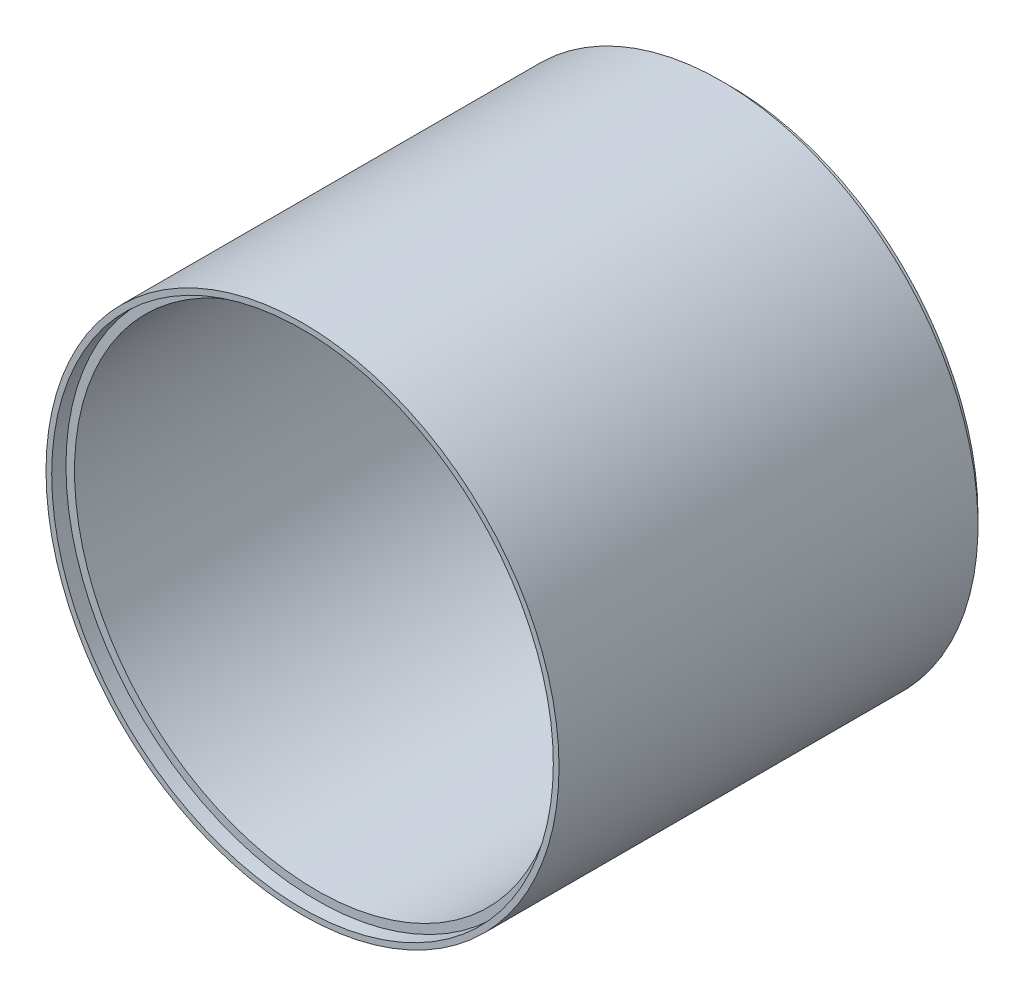
ISO-10303-21;
HEADER;
FILE_DESCRIPTION(('STEP AP214'),'2;1');
FILE_NAME('part.step','',(''),(''),'','','');
FILE_SCHEMA(('AUTOMOTIVE_DESIGN { 1 0 10303 214 1 1 1 1 }'));
ENDSEC;
DATA;
#1=APPLICATION_CONTEXT('core data for automotive mechanical design processes');
#2=APPLICATION_PROTOCOL_DEFINITION('international standard','automotive_design',2000,#1);
#3=PRODUCT_CONTEXT('',#1,'mechanical');
#4=PRODUCT('Part','Part','',(#3));
#5=PRODUCT_RELATED_PRODUCT_CATEGORY('part','',(#4));
#6=PRODUCT_DEFINITION_FORMATION('','',#4);
#7=PRODUCT_DEFINITION_CONTEXT('part definition',#1,'design');
#8=PRODUCT_DEFINITION('design','',#6,#7);
#9=PRODUCT_DEFINITION_SHAPE('','',#8);
#10=(LENGTH_UNIT() NAMED_UNIT(*) SI_UNIT(.MILLI.,.METRE.));
#11=(NAMED_UNIT(*) PLANE_ANGLE_UNIT() SI_UNIT($,.RADIAN.));
#12=(NAMED_UNIT(*) SI_UNIT($,.STERADIAN.) SOLID_ANGLE_UNIT());
#13=UNCERTAINTY_MEASURE_WITH_UNIT(LENGTH_MEASURE(1.E-05),#10,'distance_accuracy_value','');
#14=(GEOMETRIC_REPRESENTATION_CONTEXT(3) GLOBAL_UNCERTAINTY_ASSIGNED_CONTEXT((#13)) GLOBAL_UNIT_ASSIGNED_CONTEXT((#10,
#11,#12)) REPRESENTATION_CONTEXT('',''));
#15=CARTESIAN_POINT('',(0.,0.,0.));
#16=DIRECTION('',(0.,0.,1.));
#17=DIRECTION('',(1.,0.,0.));
#18=AXIS2_PLACEMENT_3D('',#15,#16,#17);
#19=CARTESIAN_POINT('',(0.,0.,20.));
#20=DIRECTION('',(0.,0.,1.));
#21=DIRECTION('',(1.,0.,0.));
#22=AXIS2_PLACEMENT_3D('',#19,#20,#21);
#23=CYLINDRICAL_SURFACE('',#22,85.);
#24=CARTESIAN_POINT('',(0.,0.,20.));
#25=DIRECTION('',(0.,0.,1.));
#26=DIRECTION('',(1.,0.,0.));
#27=AXIS2_PLACEMENT_3D('',#24,#25,#26);
#28=CIRCLE('',#27,85.);
#29=CARTESIAN_POINT('',(54.1481481481481,65.5208215159594,20.));
#30=VERTEX_POINT('',#29);
#31=CARTESIAN_POINT('',(54.1481481481481,-65.5208215159594,20.));
#32=VERTEX_POINT('',#31);
#33=EDGE_CURVE('E198',#30,#32,#28,.T.);
#34=ORIENTED_EDGE('',*,*,#33,.F.);
#35=CARTESIAN_POINT('',(0.,0.,3.));
#36=DIRECTION('',(-0.299538105961624,0.,0.954084337507394));
#37=DIRECTION('',(0.954084337507394,0.,0.299538105961624));
#38=AXIS2_PLACEMENT_3D('',#35,#36,#37);
#39=ELLIPSE('',#38,89.0906565158253,85.);
#40=EDGE_CURVE('E178',#32,#30,#39,.T.);
#41=ORIENTED_EDGE('',*,*,#40,.F.);
#42=EDGE_LOOP('',(#34,#41));
#43=FACE_BOUND('',#42,.T.);
#44=CARTESIAN_POINT('',(0.,0.,145.));
#45=DIRECTION('',(0.,0.,1.));
#46=DIRECTION('',(1.,0.,0.));
#47=AXIS2_PLACEMENT_3D('',#44,#45,#46);
#48=CIRCLE('',#47,85.);
#49=CARTESIAN_POINT('',(85.,0.,145.));
#50=VERTEX_POINT('',#49);
#51=EDGE_CURVE('E45',#50,#50,#48,.F.);
#52=ORIENTED_EDGE('',*,*,#51,.F.);
#53=EDGE_LOOP('',(#52));
#54=FACE_BOUND('',#53,.T.);
#55=ADVANCED_FACE('F39',(#43,#54),#23,.F.);
#56=CARTESIAN_POINT('',(0.,0.,150.));
#57=DIRECTION('',(0.,0.,-1.));
#58=DIRECTION('',(-1.,0.,0.));
#59=AXIS2_PLACEMENT_3D('',#56,#57,#58);
#60=CYLINDRICAL_SURFACE('',#59,67.);
#61=CARTESIAN_POINT('',(0.,0.,0.));
#62=DIRECTION('',(0.,0.,-1.));
#63=DIRECTION('',(-1.,0.,0.));
#64=AXIS2_PLACEMENT_3D('',#61,#62,#63);
#65=CIRCLE('',#64,67.);
#66=CARTESIAN_POINT('',(0.,-67.,0.));
#67=VERTEX_POINT('',#66);
#68=CARTESIAN_POINT('',(0.,67.,0.));
#69=VERTEX_POINT('',#68);
#70=EDGE_CURVE('E202',#67,#69,#65,.T.);
#71=ORIENTED_EDGE('',*,*,#70,.T.);
#72=DIRECTION('',(0.,0.,-1.));
#73=VECTOR('',#72,1.);
#74=CARTESIAN_POINT('',(0.,67.,150.));
#75=LINE('',#74,#73);
#76=CARTESIAN_POINT('',(0.,67.,1.99999999999986));
#77=VERTEX_POINT('',#76);
#78=EDGE_CURVE('E182',#69,#77,#75,.F.);
#79=ORIENTED_EDGE('',*,*,#78,.T.);
#80=CARTESIAN_POINT('',(0.,0.,1.99999999999986));
#81=DIRECTION('',(0.,0.,1.));
#82=DIRECTION('',(1.,0.,0.));
#83=AXIS2_PLACEMENT_3D('',#80,#81,#82);
#84=CIRCLE('',#83,67.);
#85=CARTESIAN_POINT('',(0.,-67.,1.99999999999986));
#86=VERTEX_POINT('',#85);
#87=EDGE_CURVE('E216',#77,#86,#84,.T.);
#88=ORIENTED_EDGE('',*,*,#87,.T.);
#89=DIRECTION('',(0.,0.,-1.));
#90=VECTOR('',#89,1.);
#91=CARTESIAN_POINT('',(0.,-67.,150.));
#92=LINE('',#91,#90);
#93=EDGE_CURVE('E192',#67,#86,#92,.F.);
#94=ORIENTED_EDGE('',*,*,#93,.F.);
#95=EDGE_LOOP('',(#71,#79,#88,#94));
#96=FACE_BOUND('',#95,.T.);
#97=ADVANCED_FACE('F265',(#96),#60,.F.);
#98=CARTESIAN_POINT('',(0.,0.,150.));
#99=DIRECTION('',(0.,0.,-1.));
#100=DIRECTION('',(-1.,0.,0.));
#101=AXIS2_PLACEMENT_3D('',#98,#99,#100);
#102=CYLINDRICAL_SURFACE('',#101,90.);
#103=CARTESIAN_POINT('',(0.,0.,150.));
#104=DIRECTION('',(0.,0.,1.));
#105=DIRECTION('',(1.,0.,0.));
#106=AXIS2_PLACEMENT_3D('',#103,#104,#105);
#107=CIRCLE('',#106,90.);
#108=CARTESIAN_POINT('',(90.,0.,150.));
#109=VERTEX_POINT('',#108);
#110=EDGE_CURVE('E213',#109,#109,#107,.T.);
#111=ORIENTED_EDGE('',*,*,#110,.F.);
#112=EDGE_LOOP('',(#111));
#113=FACE_BOUND('',#112,.T.);
#114=CARTESIAN_POINT('',(0.,0.,3.));
#115=DIRECTION('',(0.,0.,-1.));
#116=DIRECTION('',(-1.,0.,0.));
#117=AXIS2_PLACEMENT_3D('',#114,#115,#116);
#118=CIRCLE('',#117,90.);
#119=CARTESIAN_POINT('',(-90.,0.,3.));
#120=VERTEX_POINT('',#119);
#121=EDGE_CURVE('E208',#120,#120,#118,.T.);
#122=ORIENTED_EDGE('',*,*,#121,.F.);
#123=EDGE_LOOP('',(#122));
#124=FACE_BOUND('',#123,.T.);
#125=ADVANCED_FACE('F271',(#113,#124),#102,.T.);
#126=CARTESIAN_POINT('',(0.,0.,150.));
#127=DIRECTION('',(0.,0.,1.));
#128=DIRECTION('',(1.,0.,0.));
#129=AXIS2_PLACEMENT_3D('',#126,#127,#128);
#130=PLANE('',#129);
#131=CARTESIAN_POINT('',(0.,0.,150.));
#132=DIRECTION('',(0.,0.,1.));
#133=DIRECTION('',(1.,0.,0.));
#134=AXIS2_PLACEMENT_3D('',#131,#132,#133);
#135=CIRCLE('',#134,88.);
#136=CARTESIAN_POINT('',(88.,0.,150.));
#137=VERTEX_POINT('',#136);
#138=EDGE_CURVE('E454',#137,#137,#135,.T.);
#139=ORIENTED_EDGE('',*,*,#138,.F.);
#140=EDGE_LOOP('',(#139));
#141=FACE_BOUND('',#140,.T.);
#142=ORIENTED_EDGE('',*,*,#110,.T.);
#143=EDGE_LOOP('',(#142));
#144=FACE_BOUND('',#143,.T.);
#145=ADVANCED_FACE('F260',(#141,#144),#130,.T.);
#146=CARTESIAN_POINT('',(0.,0.,3.));
#147=DIRECTION('',(0.,0.,-1.));
#148=DIRECTION('',(-1.,0.,0.));
#149=AXIS2_PLACEMENT_3D('',#146,#147,#148);
#150=PLANE('',#149);
#151=CARTESIAN_POINT('',(0.,0.,3.));
#152=DIRECTION('',(0.,0.,-1.));
#153=DIRECTION('',(-1.,0.,0.));
#154=AXIS2_PLACEMENT_3D('',#151,#152,#153);
#155=CIRCLE('',#154,87.);
#156=CARTESIAN_POINT('',(-87.,0.,3.));
#157=VERTEX_POINT('',#156);
#158=EDGE_CURVE('E205',#157,#157,#155,.T.);
#159=ORIENTED_EDGE('',*,*,#158,.F.);
#160=EDGE_LOOP('',(#159));
#161=FACE_BOUND('',#160,.T.);
#162=ORIENTED_EDGE('',*,*,#121,.T.);
#163=EDGE_LOOP('',(#162));
#164=FACE_BOUND('',#163,.T.);
#165=ADVANCED_FACE('F254',(#161,#164),#150,.T.);
#166=CARTESIAN_POINT('',(0.,0.,3.));
#167=DIRECTION('',(0.,0.,-1.));
#168=DIRECTION('',(-1.,0.,0.));
#169=AXIS2_PLACEMENT_3D('',#166,#167,#168);
#170=CYLINDRICAL_SURFACE('',#169,87.);
#171=ORIENTED_EDGE('',*,*,#158,.T.);
#172=EDGE_LOOP('',(#171));
#173=FACE_BOUND('',#172,.T.);
#174=CARTESIAN_POINT('',(0.,0.,0.));
#175=DIRECTION('',(0.,0.,-1.));
#176=DIRECTION('',(-1.,0.,0.));
#177=AXIS2_PLACEMENT_3D('',#174,#175,#176);
#178=CIRCLE('',#177,87.);
#179=CARTESIAN_POINT('',(-87.,0.,0.));
#180=VERTEX_POINT('',#179);
#181=EDGE_CURVE('E204',#180,#180,#178,.T.);
#182=ORIENTED_EDGE('',*,*,#181,.F.);
#183=EDGE_LOOP('',(#182));
#184=FACE_BOUND('',#183,.T.);
#185=ADVANCED_FACE('F245',(#173,#184),#170,.T.);
#186=CARTESIAN_POINT('',(0.,0.,0.));
#187=DIRECTION('',(0.,0.,1.));
#188=DIRECTION('',(1.,0.,0.));
#189=AXIS2_PLACEMENT_3D('',#186,#187,#188);
#190=PLANE('',#189);
#191=CARTESIAN_POINT('',(14.1198656578644,72.6404115751271,0.));
#192=DIRECTION('',(0.,0.,-1.));
#193=DIRECTION('',(1.,0.,0.));
#194=AXIS2_PLACEMENT_3D('',#191,#192,#193);
#195=CIRCLE('',#194,2.);
#196=CARTESIAN_POINT('',(16.1198656578644,72.6404115751271,0.));
#197=VERTEX_POINT('',#196);
#198=EDGE_CURVE('E114',#197,#197,#195,.T.);
#199=ORIENTED_EDGE('',*,*,#198,.F.);
#200=EDGE_LOOP('',(#199));
#201=FACE_BOUND('',#200,.T.);
#202=CARTESIAN_POINT('',(38.1128175433437,63.4303802519565,0.));
#203=DIRECTION('',(0.,0.,-1.));
#204=DIRECTION('',(1.,0.,0.));
#205=AXIS2_PLACEMENT_3D('',#202,#203,#204);
#206=CIRCLE('',#205,2.);
#207=CARTESIAN_POINT('',(40.1128175433437,63.4303802519565,0.));
#208=VERTEX_POINT('',#207);
#209=EDGE_CURVE('E131',#208,#208,#206,.T.);
#210=ORIENTED_EDGE('',*,*,#209,.F.);
#211=EDGE_LOOP('',(#210));
#212=FACE_BOUND('',#211,.T.);
#213=CARTESIAN_POINT('',(-14.1198656578644,-72.6404115751271,0.));
#214=DIRECTION('',(0.,0.,-1.));
#215=DIRECTION('',(-1.,0.,0.));
#216=AXIS2_PLACEMENT_3D('',#213,#214,#215);
#217=CIRCLE('',#216,2.);
#218=CARTESIAN_POINT('',(-16.1198656578644,-72.6404115751271,0.));
#219=VERTEX_POINT('',#218);
#220=EDGE_CURVE('E234',#219,#219,#217,.T.);
#221=ORIENTED_EDGE('',*,*,#220,.F.);
#222=EDGE_LOOP('',(#221));
#223=FACE_BOUND('',#222,.T.);
#224=CARTESIAN_POINT('',(-38.1128175433437,-63.4303802519565,0.));
#225=DIRECTION('',(0.,0.,-1.));
#226=DIRECTION('',(-1.,0.,0.));
#227=AXIS2_PLACEMENT_3D('',#224,#225,#226);
#228=CIRCLE('',#227,2.);
#229=CARTESIAN_POINT('',(-40.1128175433437,-63.4303802519565,0.));
#230=VERTEX_POINT('',#229);
#231=EDGE_CURVE('E122',#230,#230,#228,.T.);
#232=ORIENTED_EDGE('',*,*,#231,.F.);
#233=EDGE_LOOP('',(#232));
#234=FACE_BOUND('',#233,.T.);
#235=ORIENTED_EDGE('',*,*,#70,.F.);
#236=DIRECTION('',(0.,1.,0.));
#237=VECTOR('',#236,1.);
#238=CARTESIAN_POINT('',(0.,-90.002,0.));
#239=LINE('',#238,#237);
#240=EDGE_CURVE('E189',#67,#69,#239,.T.);
#241=ORIENTED_EDGE('',*,*,#240,.T.);
#242=EDGE_LOOP('',(#235,#241));
#243=FACE_BOUND('',#242,.T.);
#244=ORIENTED_EDGE('',*,*,#181,.T.);
#245=EDGE_LOOP('',(#244));
#246=FACE_BOUND('',#245,.T.);
#247=ADVANCED_FACE('F242',(#201,#212,#223,#234,#243,#246),#190,.F.);
#248=CARTESIAN_POINT('',(0.,0.,20.));
#249=DIRECTION('',(0.,0.,1.));
#250=DIRECTION('',(1.,0.,0.));
#251=AXIS2_PLACEMENT_3D('',#248,#249,#250);
#252=CONICAL_SURFACE('',#251,85.,0.785398163397446);
#253=CARTESIAN_POINT('',(12.5953954273361,73.9350120989309,10.0002));
#254=CARTESIAN_POINT('',(12.5539055005675,73.8861364375923,9.94505159731924));
#255=CARTESIAN_POINT('',(12.51525466569,73.8358798346999,9.88903835120423));
#256=CARTESIAN_POINT('',(12.4435283525215,73.7330382120116,9.77567500251342));
#257=CARTESIAN_POINT('',(12.410449146893,73.6804547788053,9.7183258231274));
#258=CARTESIAN_POINT('',(12.3497280666459,73.5733618473177,9.60264687192459));
#259=CARTESIAN_POINT('',(12.3220825914501,73.5188536528942,9.54431777744164));
#260=CARTESIAN_POINT('',(12.2721138597675,73.40820020775,9.42693332575546));
#261=CARTESIAN_POINT('',(12.2497920449682,73.3520545181925,9.36787777636552));
#262=CARTESIAN_POINT('',(12.1828659801985,73.1589250799477,9.1663661310484));
#263=CARTESIAN_POINT('',(12.1507301376982,73.0186485763768,9.02272104894406));
#264=CARTESIAN_POINT('',(12.1168805112725,72.7336164860032,8.73600017400353));
#265=CARTESIAN_POINT('',(12.1152066735711,72.5888552671845,8.5929253746293));
#266=CARTESIAN_POINT('',(12.1424142823986,72.3137625295421,8.32610265776778));
#267=CARTESIAN_POINT('',(12.1680567533169,72.1835382446108,8.20192063106123));
#268=CARTESIAN_POINT('',(12.2472458416642,71.9252161966644,7.96045519633825));
#269=CARTESIAN_POINT('',(12.3007397589525,71.7971148873043,7.84315922344215));
#270=CARTESIAN_POINT('',(12.4179244213894,71.5852966783308,7.6543580051057));
#271=CARTESIAN_POINT('',(12.4735976685165,71.4999051473287,7.57975688145264));
#272=CARTESIAN_POINT('',(12.6014294700777,71.3345640739618,7.43900943421858));
#273=CARTESIAN_POINT('',(12.673565645132,71.2546073334115,7.3728518213311));
#274=CARTESIAN_POINT('',(12.8166733602652,71.1208868586155,7.26646913045777));
#275=CARTESIAN_POINT('',(12.8841131136935,71.0653230525396,7.22377702376488));
#276=CARTESIAN_POINT('',(13.0292335082082,70.9615894768474,7.14777632280236));
#277=CARTESIAN_POINT('',(13.1069009407067,70.9134103410325,7.11445579670481));
#278=CARTESIAN_POINT('',(13.2587052985167,70.8335962344724,7.06376335182821));
#279=CARTESIAN_POINT('',(13.3315410127002,70.8005558333034,7.04472475612776));
#280=CARTESIAN_POINT('',(13.48231131403,70.7430398519899,7.01627675398742));
#281=CARTESIAN_POINT('',(13.5602429130233,70.7185593049931,7.00686175733707));
#282=CARTESIAN_POINT('',(13.7192655201312,70.6792273982101,6.99836615087587));
#283=CARTESIAN_POINT('',(13.8003638875597,70.6644000809427,6.99931124056763));
#284=CARTESIAN_POINT('',(13.9629964644908,70.6448905304554,7.01152096010202));
#285=CARTESIAN_POINT('',(14.0445307600421,70.6402103803585,7.02278770821388));
#286=CARTESIAN_POINT('',(14.2029275775018,70.6406193885319,7.05424639748392));
#287=CARTESIAN_POINT('',(14.2798550336461,70.6453857177894,7.0741258717643));
#288=CARTESIAN_POINT('',(14.4302831330955,70.663194060856,7.12152854473348));
#289=CARTESIAN_POINT('',(14.5037823286416,70.6762395375944,7.14905493919899));
#290=CARTESIAN_POINT('',(14.6771240636099,70.7167584950549,7.22374153313179));
#291=CARTESIAN_POINT('',(14.7746410139593,70.7480293553429,7.27424765475845));
#292=CARTESIAN_POINT('',(14.9591897560634,70.8223130974047,7.3848777204776));
#293=CARTESIAN_POINT('',(15.0461979463577,70.8653517263288,7.44502263281008));
#294=CARTESIAN_POINT('',(15.241374855715,70.9792360962718,7.59712083305573));
#295=CARTESIAN_POINT('',(15.3445036058881,71.0543731506283,7.69231233536669));
#296=CARTESIAN_POINT('',(15.5305904666462,71.2173200221315,7.89101814018825));
#297=CARTESIAN_POINT('',(15.6135188625684,71.305148209149,7.99454440903497));
#298=CARTESIAN_POINT('',(15.7841878980739,71.520337403049,8.24134380580242));
#299=CARTESIAN_POINT('',(15.8646536113914,71.6512411085774,8.38655489155565));
#300=CARTESIAN_POINT('',(15.9933465454604,71.924257836033,8.68096725643191));
#301=CARTESIAN_POINT('',(16.0415199503408,72.0663891306414,8.83017476757548));
#302=CARTESIAN_POINT('',(16.0896303057926,72.2858368914104,9.05483419981417));
#303=CARTESIAN_POINT('',(16.1016392658093,72.3605687635505,9.13038928379813));
#304=CARTESIAN_POINT('',(16.1171426025168,72.5114063656978,9.280995329814));
#305=CARTESIAN_POINT('',(16.1206348301819,72.5875124375772,9.35604615984445));
#306=CARTESIAN_POINT('',(16.1179132686188,72.8167004914031,9.57920375714411));
#307=CARTESIAN_POINT('',(16.0986572456622,72.971350272232,9.72603063192244));
#308=CARTESIAN_POINT('',(16.0542068250919,73.1492746745956,9.89027864367059));
#309=CARTESIAN_POINT('',(16.0477028936675,73.1733963619733,9.91244600628079));
#310=CARTESIAN_POINT('',(16.0337295489383,73.2215777886917,9.95651930724711));
#311=CARTESIAN_POINT('',(16.0262605728602,73.2456375510842,9.97842535911391));
#312=CARTESIAN_POINT('',(16.0182957344345,73.2696676790895,10.0002));
#313=B_SPLINE_CURVE_WITH_KNOTS('',3,(#253,#254,#255,#256,#257,#258,#259,#260,#261,#262,#263,
#264,#265,#266,#267,#268,#269,#270,#271,#272,#273,#274,#275,#276,#277,#278,#279,#280,#281,#282,
#283,#284,#285,#286,#287,#288,#289,#290,#291,#292,#293,#294,#295,#296,#297,#298,#299,#300,#301,
#302,#303,#304,#305,#306,#307,#308,#309,#310,#311,#312),.UNSPECIFIED.,.F.,.F.,(4,2,2,2,2,2,2,2,
2,2,2,2,2,2,2,2,2,2,2,2,2,2,2,2,2,2,2,2,2,4),(0.,0.25359201170643,0.507013694425312,
0.760266880829124,1.0135885724352,1.62101237042153,2.22923265378348,2.77260048051178,
3.31494387044137,3.69274559153488,4.07003676363462,4.36074386352508,4.65107914423828,
4.89666083435582,5.14209978838783,5.38814772224133,5.63424616276089,5.87207923678844,
6.1100118551769,6.45066217171742,6.79206385801232,7.2670397623352,7.74271019176693,
8.37374263430761,9.0058241096117,9.32634451139745,9.6469457816833,10.2851456823728,
10.385340692144,10.4854904653268),.UNSPECIFIED.);
#314=CARTESIAN_POINT('',(12.5952449280983,73.9348348561166,10.));
#315=VERTEX_POINT('',#314);
#316=CARTESIAN_POINT('',(13.1097400754421,70.914246372217,7.11584862833647));
#317=VERTEX_POINT('',#316);
#318=EDGE_CURVE('E57',#315,#317,#313,.T.);
#319=ORIENTED_EDGE('',*,*,#318,.F.);
#320=CARTESIAN_POINT('',(0.,0.,10.));
#321=DIRECTION('',(0.,0.,-1.));
#322=DIRECTION('',(-1.,0.,0.));
#323=AXIS2_PLACEMENT_3D('',#320,#321,#322);
#324=CIRCLE('',#323,75.0000000000001);
#325=CARTESIAN_POINT('',(16.018368878571,73.2694469644069,10.));
#326=VERTEX_POINT('',#325);
#327=EDGE_CURVE('E11',#315,#326,#324,.T.);
#328=ORIENTED_EDGE('',*,*,#327,.T.);
#329=CARTESIAN_POINT('',(15.5066801673502,71.1993197958566,7.86837633160994));
#330=VERTEX_POINT('',#329);
#331=EDGE_CURVE('E113',#330,#326,#313,.T.);
#332=ORIENTED_EDGE('',*,*,#331,.F.);
#333=CARTESIAN_POINT('',(23.683215839208,0.,10.4354282285885));
#334=DIRECTION('',(0.299538105961624,0.,-0.954084337507394));
#335=DIRECTION('',(0.954084337507394,0.,0.299538105961624));
#336=AXIS2_PLACEMENT_3D('',#333,#334,#335);
#337=ELLIPSE('',#336,79.0657861816163,71.6212895691221);
#338=EDGE_CURVE('E172',#30,#330,#337,.F.);
#339=ORIENTED_EDGE('',*,*,#338,.F.);
#340=ORIENTED_EDGE('',*,*,#33,.T.);
#341=CARTESIAN_POINT('',(23.683215839208,0.,10.4354282285885));
#342=DIRECTION('',(-0.299538105961624,0.,0.954084337507394));
#343=DIRECTION('',(0.954084337507394,0.,0.299538105961624));
#344=AXIS2_PLACEMENT_3D('',#341,#342,#343);
#345=ELLIPSE('',#344,79.0657861816163,71.6212895691221);
#346=CARTESIAN_POINT('',(0.,-68.0000000000001,3.));
#347=VERTEX_POINT('',#346);
#348=EDGE_CURVE('E196',#32,#347,#345,.F.);
#349=ORIENTED_EDGE('',*,*,#348,.T.);
#350=DIRECTION('',(0.,-0.707106781186546,0.707106781186549));
#351=VECTOR('',#350,1.);
#352=CARTESIAN_POINT('',(0.,0.,-65.0000000000004));
#353=LINE('',#352,#351);
#354=EDGE_CURVE('E195',#347,#86,#353,.F.);
#355=ORIENTED_EDGE('',*,*,#354,.T.);
#356=ORIENTED_EDGE('',*,*,#87,.F.);
#357=DIRECTION('',(0.,0.707106781186546,0.707106781186549));
#358=VECTOR('',#357,1.);
#359=CARTESIAN_POINT('',(0.,0.,-65.0000000000004));
#360=LINE('',#359,#358);
#361=CARTESIAN_POINT('',(0.,68.0000000000001,3.));
#362=VERTEX_POINT('',#361);
#363=EDGE_CURVE('E179',#362,#77,#360,.F.);
#364=ORIENTED_EDGE('',*,*,#363,.F.);
#365=EDGE_CURVE('E119',#317,#362,#337,.F.);
#366=ORIENTED_EDGE('',*,*,#365,.F.);
#367=EDGE_LOOP('',(#319,#328,#332,#339,#340,#349,#355,#356,#364,#366));
#368=FACE_BOUND('',#367,.T.);
#369=CARTESIAN_POINT('',(-12.5953954273361,-73.9350120989309,10.0002));
#370=CARTESIAN_POINT('',(-12.5539055005675,-73.8861364375923,9.94505159731924));
#371=CARTESIAN_POINT('',(-12.51525466569,-73.8358798346999,9.88903835120423));
#372=CARTESIAN_POINT('',(-12.4435283525215,-73.7330382120116,9.77567500251342));
#373=CARTESIAN_POINT('',(-12.410449146893,-73.6804547788053,9.7183258231274));
#374=CARTESIAN_POINT('',(-12.3497280666459,-73.5733618473177,9.60264687192459));
#375=CARTESIAN_POINT('',(-12.3220825914501,-73.5188536528942,9.54431777744164));
#376=CARTESIAN_POINT('',(-12.2721138597675,-73.40820020775,9.42693332575546));
#377=CARTESIAN_POINT('',(-12.2497920449682,-73.3520545181925,9.36787777636552));
#378=CARTESIAN_POINT('',(-12.1828659801985,-73.1589250799477,9.1663661310484));
#379=CARTESIAN_POINT('',(-12.1507301376982,-73.0186485763768,9.02272104894406));
#380=CARTESIAN_POINT('',(-12.1168805112725,-72.7336164860032,8.73600017400353));
#381=CARTESIAN_POINT('',(-12.1152066735711,-72.5888552671845,8.5929253746293));
#382=CARTESIAN_POINT('',(-12.1424142823986,-72.3137625295421,8.32610265776778));
#383=CARTESIAN_POINT('',(-12.1680567533169,-72.1835382446108,8.20192063106123));
#384=CARTESIAN_POINT('',(-12.2472458416642,-71.9252161966644,7.96045519633825));
#385=CARTESIAN_POINT('',(-12.3007397589525,-71.7971148873043,7.84315922344215));
#386=CARTESIAN_POINT('',(-12.4179244213894,-71.5852966783308,7.6543580051057));
#387=CARTESIAN_POINT('',(-12.4735976685165,-71.4999051473287,7.57975688145264));
#388=CARTESIAN_POINT('',(-12.6014294700777,-71.3345640739618,7.43900943421858));
#389=CARTESIAN_POINT('',(-12.673565645132,-71.2546073334115,7.3728518213311));
#390=CARTESIAN_POINT('',(-12.8166733602652,-71.1208868586155,7.26646913045777));
#391=CARTESIAN_POINT('',(-12.8841131136935,-71.0653230525396,7.22377702376488));
#392=CARTESIAN_POINT('',(-13.0292335082082,-70.9615894768474,7.14777632280236));
#393=CARTESIAN_POINT('',(-13.1069009407067,-70.9134103410325,7.11445579670481));
#394=CARTESIAN_POINT('',(-13.2587052985167,-70.8335962344724,7.06376335182821));
#395=CARTESIAN_POINT('',(-13.3315410127002,-70.8005558333034,7.04472475612776));
#396=CARTESIAN_POINT('',(-13.48231131403,-70.7430398519899,7.01627675398742));
#397=CARTESIAN_POINT('',(-13.5602429130233,-70.7185593049931,7.00686175733707));
#398=CARTESIAN_POINT('',(-13.7192655201312,-70.6792273982101,6.99836615087587));
#399=CARTESIAN_POINT('',(-13.8003638875597,-70.6644000809427,6.99931124056763));
#400=CARTESIAN_POINT('',(-13.9629964644908,-70.6448905304554,7.01152096010202));
#401=CARTESIAN_POINT('',(-14.0445307600421,-70.6402103803585,7.02278770821388));
#402=CARTESIAN_POINT('',(-14.2029275775018,-70.6406193885319,7.05424639748392));
#403=CARTESIAN_POINT('',(-14.2798550336461,-70.6453857177894,7.0741258717643));
#404=CARTESIAN_POINT('',(-14.4302831330955,-70.663194060856,7.12152854473348));
#405=CARTESIAN_POINT('',(-14.5037823286416,-70.6762395375944,7.14905493919899));
#406=CARTESIAN_POINT('',(-14.6771240636099,-70.7167584950549,7.22374153313179));
#407=CARTESIAN_POINT('',(-14.7746410139593,-70.7480293553429,7.27424765475845));
#408=CARTESIAN_POINT('',(-14.9591897560634,-70.8223130974047,7.3848777204776));
#409=CARTESIAN_POINT('',(-15.0461979463577,-70.8653517263288,7.44502263281008));
#410=CARTESIAN_POINT('',(-15.241374855715,-70.9792360962718,7.59712083305573));
#411=CARTESIAN_POINT('',(-15.3445036058881,-71.0543731506283,7.69231233536669));
#412=CARTESIAN_POINT('',(-15.5305904666462,-71.2173200221315,7.89101814018825));
#413=CARTESIAN_POINT('',(-15.6135188625684,-71.305148209149,7.99454440903497));
#414=CARTESIAN_POINT('',(-15.7841878980739,-71.520337403049,8.24134380580242));
#415=CARTESIAN_POINT('',(-15.8646536113914,-71.6512411085774,8.38655489155565));
#416=CARTESIAN_POINT('',(-15.9933465454604,-71.924257836033,8.68096725643191));
#417=CARTESIAN_POINT('',(-16.0415199503408,-72.0663891306414,8.83017476757548));
#418=CARTESIAN_POINT('',(-16.0896303057926,-72.2858368914104,9.05483419981417));
#419=CARTESIAN_POINT('',(-16.1016392658093,-72.3605687635505,9.13038928379813));
#420=CARTESIAN_POINT('',(-16.1171426025168,-72.5114063656978,9.280995329814));
#421=CARTESIAN_POINT('',(-16.1206348301819,-72.5875124375772,9.35604615984445));
#422=CARTESIAN_POINT('',(-16.1179132686188,-72.8167004914031,9.57920375714411));
#423=CARTESIAN_POINT('',(-16.0986572456622,-72.971350272232,9.72603063192244));
#424=CARTESIAN_POINT('',(-16.0542068250919,-73.1492746745956,9.89027864367059));
#425=CARTESIAN_POINT('',(-16.0477028936675,-73.1733963619733,9.91244600628079));
#426=CARTESIAN_POINT('',(-16.0337295489383,-73.2215777886917,9.95651930724711));
#427=CARTESIAN_POINT('',(-16.0262605728602,-73.2456375510842,9.97842535911391));
#428=CARTESIAN_POINT('',(-16.0182957344345,-73.2696676790895,10.0002));
#429=B_SPLINE_CURVE_WITH_KNOTS('',3,(#369,#370,#371,#372,#373,#374,#375,#376,#377,#378,#379,
#380,#381,#382,#383,#384,#385,#386,#387,#388,#389,#390,#391,#392,#393,#394,#395,#396,#397,#398,
#399,#400,#401,#402,#403,#404,#405,#406,#407,#408,#409,#410,#411,#412,#413,#414,#415,#416,#417,
#418,#419,#420,#421,#422,#423,#424,#425,#426,#427,#428),.UNSPECIFIED.,.F.,.F.,(4,2,2,2,2,2,2,2,
2,2,2,2,2,2,2,2,2,2,2,2,2,2,2,2,2,2,2,2,2,4),(0.,0.25359201170643,0.507013694425312,
0.760266880829124,1.0135885724352,1.62101237042153,2.22923265378348,2.77260048051178,
3.31494387044137,3.69274559153488,4.07003676363462,4.36074386352508,4.65107914423828,
4.89666083435582,5.14209978838783,5.38814772224133,5.63424616276089,5.87207923678844,
6.1100118551769,6.45066217171742,6.79206385801232,7.2670397623352,7.74271019176693,
8.37374263430761,9.0058241096117,9.32634451139745,9.6469457816833,10.2851456823728,
10.385340692144,10.4854904653268),.UNSPECIFIED.);
#430=CARTESIAN_POINT('',(-12.5952449280983,-73.9348348561166,10.));
#431=VERTEX_POINT('',#430);
#432=CARTESIAN_POINT('',(-16.018368878571,-73.2694469644069,10.));
#433=VERTEX_POINT('',#432);
#434=EDGE_CURVE('E161',#431,#433,#429,.T.);
#435=ORIENTED_EDGE('',*,*,#434,.F.);
#436=CARTESIAN_POINT('',(0.,0.,10.));
#437=DIRECTION('',(0.,0.,-1.));
#438=DIRECTION('',(-1.,0.,0.));
#439=AXIS2_PLACEMENT_3D('',#436,#437,#438);
#440=CIRCLE('',#439,75.0000000000001);
#441=EDGE_CURVE('E168',#431,#433,#440,.T.);
#442=ORIENTED_EDGE('',*,*,#441,.T.);
#443=EDGE_LOOP('',(#435,#442));
#444=FACE_BOUND('',#443,.T.);
#445=CARTESIAN_POINT('',(-37.1230635738077,-65.1683063377806,10.0001999999984));
#446=CARTESIAN_POINT('',(-37.0673593350902,-65.1365686301846,9.94505159731765));
#447=CARTESIAN_POINT('',(-37.0138506602443,-65.1025622353852,9.88903835120262));
#448=CARTESIAN_POINT('',(-36.9112760665121,-65.0304545653454,9.77567500251179));
#449=CARTESIAN_POINT('',(-36.8622071877198,-64.992356055836,9.71832582312576));
#450=CARTESIAN_POINT('',(-36.768520096909,-64.9124894509477,9.60264687192293));
#451=CARTESIAN_POINT('',(-36.7238989474003,-64.8707238122643,9.54431777743998));
#452=CARTESIAN_POINT('',(-36.6390979918005,-64.7838338991696,9.42693332575378));
#453=CARTESIAN_POINT('',(-36.5989193903615,-64.7387087193005,9.36787777636384));
#454=CARTESIAN_POINT('',(-36.4699753030104,-64.5801164735898,9.16636613104663));
#455=CARTESIAN_POINT('',(-36.3918000990937,-64.4592907837723,9.02272104894223));
#456=CARTESIAN_POINT('',(-36.2625051385232,-64.2030254858425,8.73600017400157));
#457=CARTESIAN_POINT('',(-36.2114209927786,-64.067566922953,8.59292537462728));
#458=CARTESIAN_POINT('',(-36.142900524467,-63.7997587570878,8.32610265776584));
#459=CARTESIAN_POINT('',(-36.1224572365711,-63.6686177159121,8.20192063105942));
#460=CARTESIAN_POINT('',(-36.1085192946753,-63.3987901303243,7.96045519633672));
#461=CARTESIAN_POINT('',(-36.1149739058206,-63.2601182779478,7.84315922344075));
#462=CARTESIAN_POINT('',(-36.1526453741899,-63.0209947549852,7.65435800510453));
#463=CARTESIAN_POINT('',(-36.1757554900183,-62.9217115914632,7.57975688145156));
#464=CARTESIAN_POINT('',(-36.2393281130367,-62.7226207538161,7.43900943421767));
#465=CARTESIAN_POINT('',(-36.2797671285642,-62.6228139698079,7.37285182133027));
#466=CARTESIAN_POINT('',(-36.3685092964971,-62.4482121051534,7.26646913045709));
#467=CARTESIAN_POINT('',(-36.4128779942236,-62.3729334524677,7.22377702376428));
#468=CARTESIAN_POINT('',(-36.5137675856487,-62.2258216787307,7.14777632280188));
#469=CARTESIAN_POINT('',(-36.5702728639063,-62.1539842739348,7.11445579670439));
#470=CARTESIAN_POINT('',(-36.6856242665784,-62.0270633987501,7.06376335182789));
#471=CARTESIAN_POINT('',(-36.742766966983,-61.9711042961796,7.0447247561275));
#472=CARTESIAN_POINT('',(-36.8647730824039,-61.865490472892,7.01627675398725));
#473=CARTESIAN_POINT('',(-36.9296319907115,-61.815832106869,7.00686175733695));
#474=CARTESIAN_POINT('',(-37.0656120567537,-61.7244832694287,6.99836615087584));
#475=CARTESIAN_POINT('',(-37.1367483530072,-61.6828128735552,6.99931124056766));
#476=CARTESIAN_POINT('',(-37.2829003261948,-61.6088562756561,7.01152096010212));
#477=CARTESIAN_POINT('',(-37.3579167964584,-61.5765720016955,7.022787708214));
#478=CARTESIAN_POINT('',(-37.5069010060153,-61.522781441448,7.05424639748411));
#479=CARTESIAN_POINT('',(-37.5808193495057,-61.5009495863035,7.07412587176453));
#480=CARTESIAN_POINT('',(-37.7282663365653,-61.4662345147377,7.12152854473378));
#481=CARTESIAN_POINT('',(-37.8017948040775,-61.4533550475685,7.14905493919932));
#482=CARTESIAN_POINT('',(-37.9785410529395,-61.4321440478579,7.22374153313221));
#483=CARTESIAN_POINT('',(-38.080872275702,-61.4281762831811,7.27424765475895));
#484=CARTESIAN_POINT('',(-38.2796979029393,-61.434860780216,7.38487772047822));
#485=CARTESIAN_POINT('',(-38.37617893534,-61.4455453085099,7.44502263281075));
#486=CARTESIAN_POINT('',(-38.5985359853414,-61.485807176056,7.59712083305655));
#487=CARTESIAN_POINT('',(-38.7211436969701,-61.5211408016673,7.6923123353676));
#488=CARTESIAN_POINT('',(-38.9517392591957,-61.6106153196117,7.89101814018934));
#489=CARTESIAN_POINT('',(-39.0597054700091,-61.66478363699,7.99454440903613));
#490=CARTESIAN_POINT('',(-39.2936809422101,-61.8086230865861,8.24134380580372));
#491=CARTESIAN_POINT('',(-39.4140656833674,-61.9041114379031,8.38655489155702));
#492=CARTESIAN_POINT('',(-39.628374704114,-62.1166476662892,8.68096725643341));
#493=CARTESIAN_POINT('',(-39.7222546629511,-62.2337311201738,8.83017476757704));
#494=CARTESIAN_POINT('',(-39.8425191635432,-62.4234898509496,9.05483419981579));
#495=CARTESIAN_POINT('',(-39.8793637002745,-62.4896075335111,9.13038928379976));
#496=CARTESIAN_POINT('',(-39.9455215696813,-62.6260460617433,9.28099532981567));
#497=CARTESIAN_POINT('',(-39.9748329998604,-62.6963679636789,9.35604615984613));
#498=CARTESIAN_POINT('',(-40.0506624995605,-62.9126651155074,9.57920375714583));
#499=CARTESIAN_POINT('',(-40.0854610970867,-63.0645743210901,9.72603063192419));
#500=CARTESIAN_POINT('',(-40.1045450944832,-63.246971508263,9.89027864367203));
#501=CARTESIAN_POINT('',(-40.1066835010918,-63.2718629554504,9.91244600628194));
#502=CARTESIAN_POINT('',(-40.1100318706339,-63.321917851963,9.95651930724769));
#503=CARTESIAN_POINT('',(-40.1112422523103,-63.3470811734095,9.97842535911421));
#504=CARTESIAN_POINT('',(-40.1119765402404,-63.3723862425522,10.0002));
#505=B_SPLINE_CURVE_WITH_KNOTS('',3,(#445,#446,#447,#448,#449,#450,#451,#452,#453,#454,#455,
#456,#457,#458,#459,#460,#461,#462,#463,#464,#465,#466,#467,#468,#469,#470,#471,#472,#473,#474,
#475,#476,#477,#478,#479,#480,#481,#482,#483,#484,#485,#486,#487,#488,#489,#490,#491,#492,#493,
#494,#495,#496,#497,#498,#499,#500,#501,#502,#503,#504),.UNSPECIFIED.,.F.,.F.,(4,2,2,2,2,2,2,2,
2,2,2,2,2,2,2,2,2,2,2,2,2,2,2,2,2,2,2,2,2,4),(0.,0.253592011706422,0.507013694425303,
0.760266880829114,1.01358857243519,1.62101237042181,2.22923265378403,2.77260048051188,
3.314943870441,3.69274559153426,4.07003676363374,4.36074386352405,4.65107914423709,
4.89666083435457,5.14209978838652,5.38814772223996,5.63424616275946,5.87207923678703,
6.1100118551755,6.45066217171621,6.79206385801128,7.26703976233444,7.74271019176643,
8.3737426343073,9.0058241096116,9.32634451139745,9.64694578168338,10.285145682373,
10.3853406921429,10.4854904653245),.UNSPECIFIED.);
#506=CARTESIAN_POINT('',(-37.1228615301734,-65.1681912577877,10.));
#507=VERTEX_POINT('',#506);
#508=CARTESIAN_POINT('',(-40.1119697843784,-63.3721538218256,10.));
#509=VERTEX_POINT('',#508);
#510=EDGE_CURVE('E221',#507,#509,#505,.T.);
#511=ORIENTED_EDGE('',*,*,#510,.F.);
#512=CARTESIAN_POINT('',(0.,0.,10.));
#513=DIRECTION('',(0.,0.,-1.));
#514=DIRECTION('',(-1.,0.,0.));
#515=AXIS2_PLACEMENT_3D('',#512,#513,#514);
#516=CIRCLE('',#515,75.0000000000001);
#517=EDGE_CURVE('E219',#507,#509,#516,.T.);
#518=ORIENTED_EDGE('',*,*,#517,.T.);
#519=EDGE_LOOP('',(#511,#518));
#520=FACE_BOUND('',#519,.T.);
#521=ADVANCED_FACE('F42',(#368,#444,#520),#252,.F.);
#522=CARTESIAN_POINT('',(0.,-90.002,0.));
#523=DIRECTION('',(-1.,0.,0.));
#524=DIRECTION('',(0.,0.,1.));
#525=AXIS2_PLACEMENT_3D('',#522,#523,#524);
#526=PLANE('',#525);
#527=ORIENTED_EDGE('',*,*,#354,.F.);
#528=DIRECTION('',(0.,1.,0.));
#529=VECTOR('',#528,1.);
#530=CARTESIAN_POINT('',(0.,-90.002,3.));
#531=LINE('',#530,#529);
#532=EDGE_CURVE('E186',#347,#362,#531,.T.);
#533=ORIENTED_EDGE('',*,*,#532,.T.);
#534=ORIENTED_EDGE('',*,*,#363,.T.);
#535=ORIENTED_EDGE('',*,*,#78,.F.);
#536=ORIENTED_EDGE('',*,*,#240,.F.);
#537=ORIENTED_EDGE('',*,*,#93,.T.);
#538=EDGE_LOOP('',(#527,#533,#534,#535,#536,#537));
#539=FACE_BOUND('',#538,.T.);
#540=ADVANCED_FACE('F275',(#539),#526,.T.);
#541=CARTESIAN_POINT('',(0.,-90.002,3.));
#542=DIRECTION('',(-0.299538105961624,0.,0.954084337507394));
#543=DIRECTION('',(0.954084337507394,0.,0.299538105961624));
#544=AXIS2_PLACEMENT_3D('',#541,#542,#543);
#545=PLANE('',#544);
#546=CARTESIAN_POINT('',(14.1198656578644,72.6404115751271,7.43298107863184));
#547=DIRECTION('',(-0.299538105961624,0.,0.954084337507394));
#548=DIRECTION('',(-0.954084337507394,0.,-0.299538105961624));
#549=AXIS2_PLACEMENT_3D('',#546,#547,#548);
#550=ELLIPSE('',#549,2.09625074154883,2.);
#551=EDGE_CURVE('E50',#317,#330,#550,.T.);
#552=ORIENTED_EDGE('',*,*,#551,.F.);
#553=ORIENTED_EDGE('',*,*,#365,.T.);
#554=ORIENTED_EDGE('',*,*,#532,.F.);
#555=ORIENTED_EDGE('',*,*,#348,.F.);
#556=ORIENTED_EDGE('',*,*,#40,.T.);
#557=ORIENTED_EDGE('',*,*,#338,.T.);
#558=EDGE_LOOP('',(#552,#553,#554,#555,#556,#557));
#559=FACE_BOUND('',#558,.T.);
#560=ADVANCED_FACE('F175',(#559),#545,.T.);
#561=CARTESIAN_POINT('',(-38.1128175433437,-63.4303802519565,10.));
#562=DIRECTION('',(0.,0.,-1.));
#563=DIRECTION('',(-1.,0.,0.));
#564=AXIS2_PLACEMENT_3D('',#561,#562,#563);
#565=CYLINDRICAL_SURFACE('',#564,2.);
#566=ORIENTED_EDGE('',*,*,#510,.T.);
#567=CARTESIAN_POINT('',(-38.1128175433437,-63.4303802519565,10.));
#568=DIRECTION('',(0.,0.,-1.));
#569=DIRECTION('',(-1.,0.,0.));
#570=AXIS2_PLACEMENT_3D('',#567,#568,#569);
#571=CIRCLE('',#570,2.);
#572=EDGE_CURVE('E120',#507,#509,#571,.T.);
#573=ORIENTED_EDGE('',*,*,#572,.F.);
#574=EDGE_LOOP('',(#566,#573));
#575=FACE_BOUND('',#574,.T.);
#576=ORIENTED_EDGE('',*,*,#231,.T.);
#577=EDGE_LOOP('',(#576));
#578=FACE_BOUND('',#577,.T.);
#579=ADVANCED_FACE('F157',(#575,#578),#565,.F.);
#580=CARTESIAN_POINT('',(-38.1128175433437,-63.4303802519565,10.));
#581=DIRECTION('',(0.,0.,-1.));
#582=DIRECTION('',(-1.,0.,0.));
#583=AXIS2_PLACEMENT_3D('',#580,#581,#582);
#584=PLANE('',#583);
#585=ORIENTED_EDGE('',*,*,#572,.T.);
#586=ORIENTED_EDGE('',*,*,#517,.F.);
#587=EDGE_LOOP('',(#585,#586));
#588=FACE_BOUND('',#587,.T.);
#589=ADVANCED_FACE('F155',(#588),#584,.T.);
#590=CARTESIAN_POINT('',(-14.1198656578644,-72.6404115751271,10.));
#591=DIRECTION('',(0.,0.,-1.));
#592=DIRECTION('',(-1.,0.,0.));
#593=AXIS2_PLACEMENT_3D('',#590,#591,#592);
#594=CYLINDRICAL_SURFACE('',#593,2.);
#595=ORIENTED_EDGE('',*,*,#434,.T.);
#596=CARTESIAN_POINT('',(-14.1198656578644,-72.6404115751271,10.));
#597=DIRECTION('',(0.,0.,-1.));
#598=DIRECTION('',(-1.,0.,0.));
#599=AXIS2_PLACEMENT_3D('',#596,#597,#598);
#600=CIRCLE('',#599,2.);
#601=EDGE_CURVE('E64',#431,#433,#600,.T.);
#602=ORIENTED_EDGE('',*,*,#601,.F.);
#603=EDGE_LOOP('',(#595,#602));
#604=FACE_BOUND('',#603,.T.);
#605=ORIENTED_EDGE('',*,*,#220,.T.);
#606=EDGE_LOOP('',(#605));
#607=FACE_BOUND('',#606,.T.);
#608=ADVANCED_FACE('F151',(#604,#607),#594,.F.);
#609=CARTESIAN_POINT('',(-14.1198656578644,-72.6404115751271,10.));
#610=DIRECTION('',(0.,0.,-1.));
#611=DIRECTION('',(-1.,0.,0.));
#612=AXIS2_PLACEMENT_3D('',#609,#610,#611);
#613=PLANE('',#612);
#614=ORIENTED_EDGE('',*,*,#601,.T.);
#615=ORIENTED_EDGE('',*,*,#441,.F.);
#616=EDGE_LOOP('',(#614,#615));
#617=FACE_BOUND('',#616,.T.);
#618=ADVANCED_FACE('F138',(#617),#613,.T.);
#619=CARTESIAN_POINT('',(14.1198656578644,72.6404115751271,10.));
#620=DIRECTION('',(0.,0.,-1.));
#621=DIRECTION('',(-1.,0.,0.));
#622=AXIS2_PLACEMENT_3D('',#619,#620,#621);
#623=CYLINDRICAL_SURFACE('',#622,2.);
#624=ORIENTED_EDGE('',*,*,#318,.T.);
#625=ORIENTED_EDGE('',*,*,#551,.T.);
#626=ORIENTED_EDGE('',*,*,#331,.T.);
#627=CARTESIAN_POINT('',(14.1198656578644,72.6404115751271,10.));
#628=DIRECTION('',(0.,0.,-1.));
#629=DIRECTION('',(1.,0.,0.));
#630=AXIS2_PLACEMENT_3D('',#627,#628,#629);
#631=CIRCLE('',#630,2.);
#632=EDGE_CURVE('E108',#315,#326,#631,.T.);
#633=ORIENTED_EDGE('',*,*,#632,.F.);
#634=EDGE_LOOP('',(#624,#625,#626,#633));
#635=FACE_BOUND('',#634,.T.);
#636=ORIENTED_EDGE('',*,*,#198,.T.);
#637=EDGE_LOOP('',(#636));
#638=FACE_BOUND('',#637,.T.);
#639=ADVANCED_FACE('F111',(#635,#638),#623,.F.);
#640=CARTESIAN_POINT('',(14.1198656578644,72.6404115751271,10.));
#641=DIRECTION('',(0.,0.,-1.));
#642=DIRECTION('',(1.,0.,0.));
#643=AXIS2_PLACEMENT_3D('',#640,#641,#642);
#644=PLANE('',#643);
#645=ORIENTED_EDGE('',*,*,#632,.T.);
#646=ORIENTED_EDGE('',*,*,#327,.F.);
#647=EDGE_LOOP('',(#645,#646));
#648=FACE_BOUND('',#647,.T.);
#649=ADVANCED_FACE('F107',(#648),#644,.T.);
#650=CARTESIAN_POINT('',(38.1128175433437,63.4303802519565,10.));
#651=DIRECTION('',(0.,0.,-1.));
#652=DIRECTION('',(-1.,0.,0.));
#653=AXIS2_PLACEMENT_3D('',#650,#651,#652);
#654=CYLINDRICAL_SURFACE('',#653,2.);
#655=CARTESIAN_POINT('',(38.1128175433437,63.4303802519565,10.));
#656=DIRECTION('',(0.,0.,-1.));
#657=DIRECTION('',(1.,0.,0.));
#658=AXIS2_PLACEMENT_3D('',#655,#656,#657);
#659=CIRCLE('',#658,2.);
#660=CARTESIAN_POINT('',(40.1128175433437,63.4303802519565,10.));
#661=VERTEX_POINT('',#660);
#662=EDGE_CURVE('E462',#661,#661,#659,.T.);
#663=ORIENTED_EDGE('',*,*,#662,.F.);
#664=EDGE_LOOP('',(#663));
#665=FACE_BOUND('',#664,.T.);
#666=ORIENTED_EDGE('',*,*,#209,.T.);
#667=EDGE_LOOP('',(#666));
#668=FACE_BOUND('',#667,.T.);
#669=ADVANCED_FACE('F144',(#665,#668),#654,.F.);
#670=CARTESIAN_POINT('',(38.1128175433437,63.4303802519565,10.));
#671=DIRECTION('',(0.,0.,-1.));
#672=DIRECTION('',(1.,0.,0.));
#673=AXIS2_PLACEMENT_3D('',#670,#671,#672);
#674=PLANE('',#673);
#675=ORIENTED_EDGE('',*,*,#662,.T.);
#676=EDGE_LOOP('',(#675));
#677=FACE_BOUND('',#676,.T.);
#678=ADVANCED_FACE('F140',(#677),#674,.T.);
#679=CARTESIAN_POINT('',(0.,0.,145.));
#680=DIRECTION('',(0.,0.,1.));
#681=DIRECTION('',(1.,0.,0.));
#682=AXIS2_PLACEMENT_3D('',#679,#680,#681);
#683=PLANE('',#682);
#684=CARTESIAN_POINT('',(0.,0.,145.));
#685=DIRECTION('',(0.,0.,1.));
#686=DIRECTION('',(1.,0.,0.));
#687=AXIS2_PLACEMENT_3D('',#684,#685,#686);
#688=CIRCLE('',#687,88.);
#689=CARTESIAN_POINT('',(88.,0.,145.));
#690=VERTEX_POINT('',#689);
#691=EDGE_CURVE('E456',#690,#690,#688,.T.);
#692=ORIENTED_EDGE('',*,*,#691,.T.);
#693=EDGE_LOOP('',(#692));
#694=FACE_BOUND('',#693,.T.);
#695=ORIENTED_EDGE('',*,*,#51,.T.);
#696=EDGE_LOOP('',(#695));
#697=FACE_BOUND('',#696,.T.);
#698=ADVANCED_FACE('F143',(#694,#697),#683,.T.);
#699=CARTESIAN_POINT('',(0.,0.,145.));
#700=DIRECTION('',(0.,0.,1.));
#701=DIRECTION('',(1.,0.,0.));
#702=AXIS2_PLACEMENT_3D('',#699,#700,#701);
#703=CYLINDRICAL_SURFACE('',#702,88.);
#704=ORIENTED_EDGE('',*,*,#691,.F.);
#705=EDGE_LOOP('',(#704));
#706=FACE_BOUND('',#705,.T.);
#707=ORIENTED_EDGE('',*,*,#138,.T.);
#708=EDGE_LOOP('',(#707));
#709=FACE_BOUND('',#708,.T.);
#710=ADVANCED_FACE('F389',(#706,#709),#703,.F.);
#711=CLOSED_SHELL('',(#55,#97,#125,#145,#165,#185,#247,#521,#540,#560,#579,#589,#608,#618,#639,
#649,#669,#678,#698,#710));
#712=MANIFOLD_SOLID_BREP('B2',#711);
#713=ADVANCED_BREP_SHAPE_REPRESENTATION('',(#18,#712),#14);
#714=SHAPE_DEFINITION_REPRESENTATION(#9,#713);
ENDSEC;
END-ISO-10303-21;
